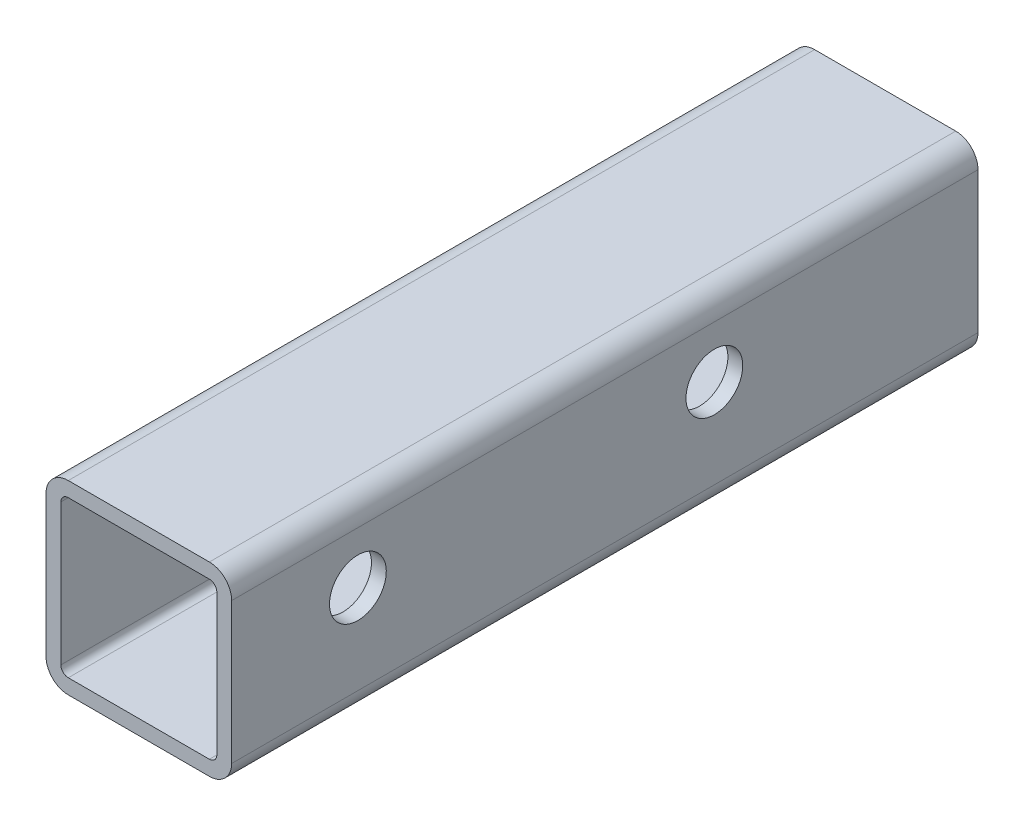
ISO-10303-21;
HEADER;
FILE_DESCRIPTION(('STEP AP214'),'2;1');
FILE_NAME('part.step','',(''),(''),'','','');
FILE_SCHEMA(('AUTOMOTIVE_DESIGN { 1 0 10303 214 1 1 1 1 }'));
ENDSEC;
DATA;
#1=APPLICATION_CONTEXT('core data for automotive mechanical design processes');
#2=APPLICATION_PROTOCOL_DEFINITION('international standard','automotive_design',2000,#1);
#3=PRODUCT_CONTEXT('',#1,'mechanical');
#4=PRODUCT('Part','Part','',(#3));
#5=PRODUCT_RELATED_PRODUCT_CATEGORY('part','',(#4));
#6=PRODUCT_DEFINITION_FORMATION('','',#4);
#7=PRODUCT_DEFINITION_CONTEXT('part definition',#1,'design');
#8=PRODUCT_DEFINITION('design','',#6,#7);
#9=PRODUCT_DEFINITION_SHAPE('','',#8);
#10=(LENGTH_UNIT() NAMED_UNIT(*) SI_UNIT(.MILLI.,.METRE.));
#11=(NAMED_UNIT(*) PLANE_ANGLE_UNIT() SI_UNIT($,.RADIAN.));
#12=(NAMED_UNIT(*) SI_UNIT($,.STERADIAN.) SOLID_ANGLE_UNIT());
#13=UNCERTAINTY_MEASURE_WITH_UNIT(LENGTH_MEASURE(1.E-05),#10,'distance_accuracy_value','');
#14=(GEOMETRIC_REPRESENTATION_CONTEXT(3) GLOBAL_UNCERTAINTY_ASSIGNED_CONTEXT((#13)) GLOBAL_UNIT_ASSIGNED_CONTEXT((#10,
#11,#12)) REPRESENTATION_CONTEXT('',''));
#15=CARTESIAN_POINT('',(0.,0.,0.));
#16=DIRECTION('',(0.,0.,1.));
#17=DIRECTION('',(1.,0.,0.));
#18=AXIS2_PLACEMENT_3D('',#15,#16,#17);
#19=CARTESIAN_POINT('',(-5.40456568387526E-12,-5.25801624462474E-12,100.500000000007));
#20=DIRECTION('',(0.,0.,1.));
#21=DIRECTION('',(0.,-1.,0.));
#22=AXIS2_PLACEMENT_3D('',#19,#20,#21);
#23=PLANE('',#22);
#24=DIRECTION('',(0.,1.,0.));
#25=VECTOR('',#24,1.);
#26=CARTESIAN_POINT('',(-12.5000000000054,-4.75000000000541,100.500000000007));
#27=LINE('',#26,#25);
#28=CARTESIAN_POINT('',(-12.5000000000054,-9.50000000000536,100.500000000007));
#29=VERTEX_POINT('',#28);
#30=CARTESIAN_POINT('',(-12.5000000000054,9.49999999999463,100.500000000007));
#31=VERTEX_POINT('',#30);
#32=EDGE_CURVE('E167',#29,#31,#27,.T.);
#33=ORIENTED_EDGE('',*,*,#32,.F.);
#34=CARTESIAN_POINT('',(-9.5000000000054,-9.50000000000529,100.500000000007));
#35=DIRECTION('',(0.,0.,-1.));
#36=DIRECTION('',(1.,0.,0.));
#37=AXIS2_PLACEMENT_3D('',#34,#35,#36);
#38=CIRCLE('',#37,3.);
#39=CARTESIAN_POINT('',(-9.50000000000539,-12.5000000000053,100.500000000007));
#40=VERTEX_POINT('',#39);
#41=EDGE_CURVE('E185',#40,#29,#38,.T.);
#42=ORIENTED_EDGE('',*,*,#41,.F.);
#43=DIRECTION('',(-1.,0.,0.));
#44=VECTOR('',#43,1.);
#45=CARTESIAN_POINT('',(4.7499999999946,-12.5000000000053,100.500000000007));
#46=LINE('',#45,#44);
#47=CARTESIAN_POINT('',(9.49999999999459,-12.5000000000053,100.500000000007));
#48=VERTEX_POINT('',#47);
#49=EDGE_CURVE('E260',#48,#40,#46,.T.);
#50=ORIENTED_EDGE('',*,*,#49,.F.);
#51=CARTESIAN_POINT('',(9.49999999999459,-9.50000000000529,100.500000000007));
#52=DIRECTION('',(0.,0.,-1.));
#53=DIRECTION('',(0.,1.,0.));
#54=AXIS2_PLACEMENT_3D('',#51,#52,#53);
#55=CIRCLE('',#54,3.);
#56=CARTESIAN_POINT('',(12.4999999999946,-9.50000000000529,100.500000000007));
#57=VERTEX_POINT('',#56);
#58=EDGE_CURVE('E265',#57,#48,#55,.T.);
#59=ORIENTED_EDGE('',*,*,#58,.F.);
#60=DIRECTION('',(0.,-1.,0.));
#61=VECTOR('',#60,1.);
#62=CARTESIAN_POINT('',(12.4999999999946,4.74999999999469,100.500000000007));
#63=LINE('',#62,#61);
#64=CARTESIAN_POINT('',(12.4999999999946,9.4999999999947,100.500000000007));
#65=VERTEX_POINT('',#64);
#66=EDGE_CURVE('E241',#65,#57,#63,.T.);
#67=ORIENTED_EDGE('',*,*,#66,.F.);
#68=CARTESIAN_POINT('',(9.49999999999459,9.49999999999477,100.500000000007));
#69=DIRECTION('',(0.,0.,-1.));
#70=DIRECTION('',(-1.,0.,0.));
#71=AXIS2_PLACEMENT_3D('',#68,#69,#70);
#72=CIRCLE('',#71,3.);
#73=CARTESIAN_POINT('',(9.49999999999459,12.4999999999947,100.500000000007));
#74=VERTEX_POINT('',#73);
#75=EDGE_CURVE('E27',#74,#65,#72,.T.);
#76=ORIENTED_EDGE('',*,*,#75,.F.);
#77=DIRECTION('',(1.,0.,0.));
#78=VECTOR('',#77,1.);
#79=CARTESIAN_POINT('',(-4.75000000000541,12.4999999999946,100.500000000007));
#80=LINE('',#79,#78);
#81=CARTESIAN_POINT('',(-9.50000000000541,12.4999999999947,100.500000000007));
#82=VERTEX_POINT('',#81);
#83=EDGE_CURVE('E169',#82,#74,#80,.T.);
#84=ORIENTED_EDGE('',*,*,#83,.F.);
#85=CARTESIAN_POINT('',(-9.5000000000054,9.49999999999477,100.500000000007));
#86=DIRECTION('',(0.,0.,-1.));
#87=DIRECTION('',(0.,-1.,0.));
#88=AXIS2_PLACEMENT_3D('',#85,#86,#87);
#89=CIRCLE('',#88,3.);
#90=EDGE_CURVE('E218',#31,#82,#89,.T.);
#91=ORIENTED_EDGE('',*,*,#90,.F.);
#92=EDGE_LOOP('',(#33,#42,#50,#59,#67,#76,#84,#91));
#93=FACE_BOUND('',#92,.T.);
#94=DIRECTION('',(-1.,0.,0.));
#95=VECTOR('',#94,1.);
#96=CARTESIAN_POINT('',(-4.75000000000541,10.4999999999947,100.500000000007));
#97=LINE('',#96,#95);
#98=CARTESIAN_POINT('',(9.49999999999459,10.4999999999947,100.500000000007));
#99=VERTEX_POINT('',#98);
#100=CARTESIAN_POINT('',(-9.5000000000054,10.4999999999947,100.500000000007));
#101=VERTEX_POINT('',#100);
#102=EDGE_CURVE('E98',#99,#101,#97,.T.);
#103=ORIENTED_EDGE('',*,*,#102,.F.);
#104=CARTESIAN_POINT('',(9.49999999999459,9.49999999999477,100.500000000007));
#105=DIRECTION('',(0.,0.,1.));
#106=DIRECTION('',(-1.,0.,0.));
#107=AXIS2_PLACEMENT_3D('',#104,#105,#106);
#108=CIRCLE('',#107,1.);
#109=CARTESIAN_POINT('',(10.4999999999946,9.49999999999477,100.500000000007));
#110=VERTEX_POINT('',#109);
#111=EDGE_CURVE('E212',#110,#99,#108,.T.);
#112=ORIENTED_EDGE('',*,*,#111,.F.);
#113=DIRECTION('',(0.,1.,0.));
#114=VECTOR('',#113,1.);
#115=CARTESIAN_POINT('',(10.4999999999946,4.74999999999476,100.500000000007));
#116=LINE('',#115,#114);
#117=CARTESIAN_POINT('',(10.4999999999946,-9.50000000000529,100.500000000007));
#118=VERTEX_POINT('',#117);
#119=EDGE_CURVE('E205',#118,#110,#116,.T.);
#120=ORIENTED_EDGE('',*,*,#119,.F.);
#121=CARTESIAN_POINT('',(9.49999999999459,-9.50000000000529,100.500000000007));
#122=DIRECTION('',(0.,0.,1.));
#123=DIRECTION('',(0.,1.,0.));
#124=AXIS2_PLACEMENT_3D('',#121,#122,#123);
#125=CIRCLE('',#124,1.);
#126=CARTESIAN_POINT('',(9.49999999999459,-10.5000000000052,100.500000000007));
#127=VERTEX_POINT('',#126);
#128=EDGE_CURVE('E190',#127,#118,#125,.T.);
#129=ORIENTED_EDGE('',*,*,#128,.F.);
#130=DIRECTION('',(1.,0.,0.));
#131=VECTOR('',#130,1.);
#132=CARTESIAN_POINT('',(4.7499999999946,-10.5000000000053,100.500000000007));
#133=LINE('',#132,#131);
#134=CARTESIAN_POINT('',(-9.5000000000054,-10.5000000000052,100.500000000007));
#135=VERTEX_POINT('',#134);
#136=EDGE_CURVE('E293',#135,#127,#133,.T.);
#137=ORIENTED_EDGE('',*,*,#136,.F.);
#138=CARTESIAN_POINT('',(-9.5000000000054,-9.50000000000529,100.500000000007));
#139=DIRECTION('',(0.,0.,1.));
#140=DIRECTION('',(1.,0.,0.));
#141=AXIS2_PLACEMENT_3D('',#138,#139,#140);
#142=CIRCLE('',#141,1.);
#143=CARTESIAN_POINT('',(-10.5000000000054,-9.50000000000529,100.500000000007));
#144=VERTEX_POINT('',#143);
#145=EDGE_CURVE('E282',#144,#135,#142,.T.);
#146=ORIENTED_EDGE('',*,*,#145,.F.);
#147=DIRECTION('',(0.,-1.,0.));
#148=VECTOR('',#147,1.);
#149=CARTESIAN_POINT('',(-10.5000000000054,-4.75000000000527,100.500000000007));
#150=LINE('',#149,#148);
#151=CARTESIAN_POINT('',(-10.5000000000054,9.49999999999477,100.500000000007));
#152=VERTEX_POINT('',#151);
#153=EDGE_CURVE('E142',#152,#144,#150,.T.);
#154=ORIENTED_EDGE('',*,*,#153,.F.);
#155=CARTESIAN_POINT('',(-9.5000000000054,9.49999999999477,100.500000000007));
#156=DIRECTION('',(0.,0.,1.));
#157=DIRECTION('',(0.,-1.,0.));
#158=AXIS2_PLACEMENT_3D('',#155,#156,#157);
#159=CIRCLE('',#158,1.);
#160=EDGE_CURVE('E140',#101,#152,#159,.T.);
#161=ORIENTED_EDGE('',*,*,#160,.F.);
#162=EDGE_LOOP('',(#103,#112,#120,#129,#137,#146,#154,#161));
#163=FACE_BOUND('',#162,.T.);
#164=ADVANCED_FACE('F16',(#93,#163),#23,.T.);
#165=CARTESIAN_POINT('',(-5.40456568387526E-12,-5.25801624462474E-12,7.38964445190504E-12));
#166=DIRECTION('',(0.,0.,1.));
#167=DIRECTION('',(0.,-1.,0.));
#168=AXIS2_PLACEMENT_3D('',#165,#166,#167);
#169=PLANE('',#168);
#170=DIRECTION('',(0.,1.,0.));
#171=VECTOR('',#170,1.);
#172=CARTESIAN_POINT('',(-12.5000000000054,-4.75000000000541,7.38964445190504E-12));
#173=LINE('',#172,#171);
#174=CARTESIAN_POINT('',(-12.5000000000054,-9.50000000000536,7.38964445190504E-12));
#175=VERTEX_POINT('',#174);
#176=CARTESIAN_POINT('',(-12.5000000000054,9.49999999999463,7.38964445190504E-12));
#177=VERTEX_POINT('',#176);
#178=EDGE_CURVE('E215',#175,#177,#173,.T.);
#179=ORIENTED_EDGE('',*,*,#178,.T.);
#180=CARTESIAN_POINT('',(-9.50000000000541,9.49999999999477,7.38964445190504E-12));
#181=DIRECTION('',(0.,0.,-1.));
#182=DIRECTION('',(0.,-1.,0.));
#183=AXIS2_PLACEMENT_3D('',#180,#181,#182);
#184=CIRCLE('',#183,3.);
#185=CARTESIAN_POINT('',(-9.50000000000541,12.4999999999947,7.38964445190504E-12));
#186=VERTEX_POINT('',#185);
#187=EDGE_CURVE('E174',#177,#186,#184,.T.);
#188=ORIENTED_EDGE('',*,*,#187,.T.);
#189=DIRECTION('',(1.,0.,0.));
#190=VECTOR('',#189,1.);
#191=CARTESIAN_POINT('',(-4.75000000000541,12.4999999999946,7.38964445190504E-12));
#192=LINE('',#191,#190);
#193=CARTESIAN_POINT('',(9.49999999999459,12.4999999999947,7.38964445190504E-12));
#194=VERTEX_POINT('',#193);
#195=EDGE_CURVE('E276',#186,#194,#192,.T.);
#196=ORIENTED_EDGE('',*,*,#195,.T.);
#197=CARTESIAN_POINT('',(9.49999999999459,9.49999999999477,7.38964445190504E-12));
#198=DIRECTION('',(0.,0.,-1.));
#199=DIRECTION('',(-1.,0.,0.));
#200=AXIS2_PLACEMENT_3D('',#197,#198,#199);
#201=CIRCLE('',#200,3.);
#202=CARTESIAN_POINT('',(12.4999999999946,9.4999999999947,7.38964445190504E-12));
#203=VERTEX_POINT('',#202);
#204=EDGE_CURVE('E11',#194,#203,#201,.T.);
#205=ORIENTED_EDGE('',*,*,#204,.T.);
#206=DIRECTION('',(0.,-1.,0.));
#207=VECTOR('',#206,1.);
#208=CARTESIAN_POINT('',(12.4999999999946,4.74999999999469,7.38964445190504E-12));
#209=LINE('',#208,#207);
#210=CARTESIAN_POINT('',(12.4999999999946,-9.50000000000529,7.38964445190504E-12));
#211=VERTEX_POINT('',#210);
#212=EDGE_CURVE('E266',#203,#211,#209,.T.);
#213=ORIENTED_EDGE('',*,*,#212,.T.);
#214=CARTESIAN_POINT('',(9.49999999999459,-9.50000000000529,7.38964445190504E-12));
#215=DIRECTION('',(0.,0.,-1.));
#216=DIRECTION('',(0.,1.,0.));
#217=AXIS2_PLACEMENT_3D('',#214,#215,#216);
#218=CIRCLE('',#217,3.);
#219=CARTESIAN_POINT('',(9.49999999999459,-12.5000000000053,7.38964445190504E-12));
#220=VERTEX_POINT('',#219);
#221=EDGE_CURVE('E306',#211,#220,#218,.T.);
#222=ORIENTED_EDGE('',*,*,#221,.T.);
#223=DIRECTION('',(-1.,0.,0.));
#224=VECTOR('',#223,1.);
#225=CARTESIAN_POINT('',(4.7499999999946,-12.5000000000053,7.38964445190504E-12));
#226=LINE('',#225,#224);
#227=CARTESIAN_POINT('',(-9.5000000000054,-12.5000000000053,7.38964445190504E-12));
#228=VERTEX_POINT('',#227);
#229=EDGE_CURVE('E181',#220,#228,#226,.T.);
#230=ORIENTED_EDGE('',*,*,#229,.T.);
#231=CARTESIAN_POINT('',(-9.5000000000054,-9.50000000000529,7.38964445190504E-12));
#232=DIRECTION('',(0.,0.,-1.));
#233=DIRECTION('',(1.,0.,0.));
#234=AXIS2_PLACEMENT_3D('',#231,#232,#233);
#235=CIRCLE('',#234,3.);
#236=EDGE_CURVE('E156',#228,#175,#235,.T.);
#237=ORIENTED_EDGE('',*,*,#236,.T.);
#238=EDGE_LOOP('',(#179,#188,#196,#205,#213,#222,#230,#237));
#239=FACE_BOUND('',#238,.T.);
#240=DIRECTION('',(-1.,0.,0.));
#241=VECTOR('',#240,1.);
#242=CARTESIAN_POINT('',(-4.75000000000541,10.4999999999947,7.38964445190504E-12));
#243=LINE('',#242,#241);
#244=CARTESIAN_POINT('',(9.49999999999459,10.4999999999947,7.38964445190504E-12));
#245=VERTEX_POINT('',#244);
#246=CARTESIAN_POINT('',(-9.5000000000054,10.4999999999947,7.38964445190504E-12));
#247=VERTEX_POINT('',#246);
#248=EDGE_CURVE('E81',#245,#247,#243,.T.);
#249=ORIENTED_EDGE('',*,*,#248,.T.);
#250=CARTESIAN_POINT('',(-9.50000000000541,9.49999999999477,7.38964445190504E-12));
#251=DIRECTION('',(0.,0.,1.));
#252=DIRECTION('',(0.,-1.,0.));
#253=AXIS2_PLACEMENT_3D('',#250,#251,#252);
#254=CIRCLE('',#253,1.);
#255=CARTESIAN_POINT('',(-10.5000000000054,9.49999999999477,7.38964445190504E-12));
#256=VERTEX_POINT('',#255);
#257=EDGE_CURVE('E135',#247,#256,#254,.T.);
#258=ORIENTED_EDGE('',*,*,#257,.T.);
#259=DIRECTION('',(0.,-1.,0.));
#260=VECTOR('',#259,1.);
#261=CARTESIAN_POINT('',(-10.5000000000054,-4.75000000000527,7.38964445190504E-12));
#262=LINE('',#261,#260);
#263=CARTESIAN_POINT('',(-10.5000000000054,-9.50000000000529,7.38964445190504E-12));
#264=VERTEX_POINT('',#263);
#265=EDGE_CURVE('E193',#256,#264,#262,.T.);
#266=ORIENTED_EDGE('',*,*,#265,.T.);
#267=CARTESIAN_POINT('',(-9.5000000000054,-9.50000000000529,7.38964445190504E-12));
#268=DIRECTION('',(0.,0.,1.));
#269=DIRECTION('',(1.,0.,0.));
#270=AXIS2_PLACEMENT_3D('',#267,#268,#269);
#271=CIRCLE('',#270,1.);
#272=CARTESIAN_POINT('',(-9.5000000000054,-10.5000000000052,7.38964445190504E-12));
#273=VERTEX_POINT('',#272);
#274=EDGE_CURVE('E281',#264,#273,#271,.T.);
#275=ORIENTED_EDGE('',*,*,#274,.T.);
#276=DIRECTION('',(1.,0.,0.));
#277=VECTOR('',#276,1.);
#278=CARTESIAN_POINT('',(4.7499999999946,-10.5000000000053,7.38964445190504E-12));
#279=LINE('',#278,#277);
#280=CARTESIAN_POINT('',(9.49999999999459,-10.5000000000052,7.38964445190504E-12));
#281=VERTEX_POINT('',#280);
#282=EDGE_CURVE('E175',#273,#281,#279,.T.);
#283=ORIENTED_EDGE('',*,*,#282,.T.);
#284=CARTESIAN_POINT('',(9.49999999999459,-9.50000000000529,7.38964445190504E-12));
#285=DIRECTION('',(0.,0.,1.));
#286=DIRECTION('',(0.,1.,0.));
#287=AXIS2_PLACEMENT_3D('',#284,#285,#286);
#288=CIRCLE('',#287,1.);
#289=CARTESIAN_POINT('',(10.4999999999946,-9.50000000000529,7.38964445190504E-12));
#290=VERTEX_POINT('',#289);
#291=EDGE_CURVE('E230',#281,#290,#288,.T.);
#292=ORIENTED_EDGE('',*,*,#291,.T.);
#293=DIRECTION('',(0.,1.,0.));
#294=VECTOR('',#293,1.);
#295=CARTESIAN_POINT('',(10.4999999999946,4.74999999999476,7.38964445190504E-12));
#296=LINE('',#295,#294);
#297=CARTESIAN_POINT('',(10.4999999999946,9.49999999999477,7.38964445190504E-12));
#298=VERTEX_POINT('',#297);
#299=EDGE_CURVE('E204',#290,#298,#296,.T.);
#300=ORIENTED_EDGE('',*,*,#299,.T.);
#301=CARTESIAN_POINT('',(9.49999999999459,9.49999999999477,7.38964445190504E-12));
#302=DIRECTION('',(0.,0.,1.));
#303=DIRECTION('',(-1.,0.,0.));
#304=AXIS2_PLACEMENT_3D('',#301,#302,#303);
#305=CIRCLE('',#304,1.);
#306=EDGE_CURVE('E211',#298,#245,#305,.T.);
#307=ORIENTED_EDGE('',*,*,#306,.T.);
#308=EDGE_LOOP('',(#249,#258,#266,#275,#283,#292,#300,#307));
#309=FACE_BOUND('',#308,.T.);
#310=ADVANCED_FACE('F228',(#239,#309),#169,.F.);
#311=CARTESIAN_POINT('',(9.49999999999459,9.49999999999477,7.38964445190504E-12));
#312=DIRECTION('',(0.,0.,1.));
#313=DIRECTION('',(-1.,0.,0.));
#314=AXIS2_PLACEMENT_3D('',#311,#312,#313);
#315=CYLINDRICAL_SURFACE('',#314,3.);
#316=ORIENTED_EDGE('',*,*,#75,.T.);
#317=DIRECTION('',(0.,0.,1.));
#318=VECTOR('',#317,1.);
#319=CARTESIAN_POINT('',(12.4999999999946,9.4999999999947,7.38964445190504E-12));
#320=LINE('',#319,#318);
#321=EDGE_CURVE('E261',#203,#65,#320,.T.);
#322=ORIENTED_EDGE('',*,*,#321,.F.);
#323=ORIENTED_EDGE('',*,*,#204,.F.);
#324=DIRECTION('',(0.,0.,1.));
#325=VECTOR('',#324,1.);
#326=CARTESIAN_POINT('',(9.49999999999459,12.4999999999947,7.38964445190504E-12));
#327=LINE('',#326,#325);
#328=EDGE_CURVE('E173',#194,#74,#327,.T.);
#329=ORIENTED_EDGE('',*,*,#328,.T.);
#330=EDGE_LOOP('',(#316,#322,#323,#329));
#331=FACE_BOUND('',#330,.T.);
#332=ADVANCED_FACE('F340',(#331),#315,.T.);
#333=CARTESIAN_POINT('',(-9.50000000000541,12.4999999999947,7.38964445190504E-12));
#334=DIRECTION('',(0.,1.,0.));
#335=DIRECTION('',(1.,0.,0.));
#336=AXIS2_PLACEMENT_3D('',#333,#334,#335);
#337=PLANE('',#336);
#338=ORIENTED_EDGE('',*,*,#83,.T.);
#339=ORIENTED_EDGE('',*,*,#328,.F.);
#340=ORIENTED_EDGE('',*,*,#195,.F.);
#341=DIRECTION('',(0.,0.,1.));
#342=VECTOR('',#341,1.);
#343=CARTESIAN_POINT('',(-9.50000000000541,12.4999999999947,7.38964445190504E-12));
#344=LINE('',#343,#342);
#345=EDGE_CURVE('E273',#186,#82,#344,.T.);
#346=ORIENTED_EDGE('',*,*,#345,.T.);
#347=EDGE_LOOP('',(#338,#339,#340,#346));
#348=FACE_BOUND('',#347,.T.);
#349=ADVANCED_FACE('F345',(#348),#337,.T.);
#350=CARTESIAN_POINT('',(-9.50000000000541,9.49999999999477,7.38964445190504E-12));
#351=DIRECTION('',(0.,0.,1.));
#352=DIRECTION('',(0.,-1.,0.));
#353=AXIS2_PLACEMENT_3D('',#350,#351,#352);
#354=CYLINDRICAL_SURFACE('',#353,3.);
#355=ORIENTED_EDGE('',*,*,#90,.T.);
#356=ORIENTED_EDGE('',*,*,#345,.F.);
#357=ORIENTED_EDGE('',*,*,#187,.F.);
#358=DIRECTION('',(0.,0.,1.));
#359=VECTOR('',#358,1.);
#360=CARTESIAN_POINT('',(-12.5000000000054,9.49999999999463,7.38964445190504E-12));
#361=LINE('',#360,#359);
#362=EDGE_CURVE('E219',#177,#31,#361,.T.);
#363=ORIENTED_EDGE('',*,*,#362,.T.);
#364=EDGE_LOOP('',(#355,#356,#357,#363));
#365=FACE_BOUND('',#364,.T.);
#366=ADVANCED_FACE('F18',(#365),#354,.T.);
#367=CARTESIAN_POINT('',(-12.5000000000054,-9.50000000000536,7.38964445190504E-12));
#368=DIRECTION('',(-1.,0.,0.));
#369=DIRECTION('',(0.,1.,0.));
#370=AXIS2_PLACEMENT_3D('',#367,#368,#369);
#371=PLANE('',#370);
#372=ORIENTED_EDGE('',*,*,#32,.T.);
#373=ORIENTED_EDGE('',*,*,#362,.F.);
#374=ORIENTED_EDGE('',*,*,#178,.F.);
#375=DIRECTION('',(0.,0.,1.));
#376=VECTOR('',#375,1.);
#377=CARTESIAN_POINT('',(-12.5000000000054,-9.50000000000536,7.38964445190504E-12));
#378=LINE('',#377,#376);
#379=EDGE_CURVE('E163',#175,#29,#378,.T.);
#380=ORIENTED_EDGE('',*,*,#379,.T.);
#381=EDGE_LOOP('',(#372,#373,#374,#380));
#382=FACE_BOUND('',#381,.T.);
#383=ADVANCED_FACE('F373',(#382),#371,.T.);
#384=CARTESIAN_POINT('',(-9.50000000000541,9.49999999999477,7.38964445190504E-12));
#385=DIRECTION('',(0.,0.,1.));
#386=DIRECTION('',(0.,-1.,0.));
#387=AXIS2_PLACEMENT_3D('',#384,#385,#386);
#388=CYLINDRICAL_SURFACE('',#387,1.);
#389=ORIENTED_EDGE('',*,*,#160,.T.);
#390=DIRECTION('',(0.,0.,1.));
#391=VECTOR('',#390,1.);
#392=CARTESIAN_POINT('',(-10.5000000000054,9.49999999999477,7.38964445190504E-12));
#393=LINE('',#392,#391);
#394=EDGE_CURVE('E145',#256,#152,#393,.T.);
#395=ORIENTED_EDGE('',*,*,#394,.F.);
#396=ORIENTED_EDGE('',*,*,#257,.F.);
#397=DIRECTION('',(0.,0.,1.));
#398=VECTOR('',#397,1.);
#399=CARTESIAN_POINT('',(-9.5000000000054,10.4999999999947,7.38964445190504E-12));
#400=LINE('',#399,#398);
#401=EDGE_CURVE('E147',#247,#101,#400,.T.);
#402=ORIENTED_EDGE('',*,*,#401,.T.);
#403=EDGE_LOOP('',(#389,#395,#396,#402));
#404=FACE_BOUND('',#403,.T.);
#405=ADVANCED_FACE('F148',(#404),#388,.F.);
#406=CARTESIAN_POINT('',(-10.5000000000054,-9.50000000000529,7.38964445190504E-12));
#407=DIRECTION('',(-1.,0.,0.));
#408=DIRECTION('',(0.,1.,0.));
#409=AXIS2_PLACEMENT_3D('',#406,#407,#408);
#410=PLANE('',#409);
#411=ORIENTED_EDGE('',*,*,#153,.T.);
#412=DIRECTION('',(0.,0.,1.));
#413=VECTOR('',#412,1.);
#414=CARTESIAN_POINT('',(-10.5000000000054,-9.50000000000529,7.38964445190504E-12));
#415=LINE('',#414,#413);
#416=EDGE_CURVE('E277',#264,#144,#415,.T.);
#417=ORIENTED_EDGE('',*,*,#416,.F.);
#418=ORIENTED_EDGE('',*,*,#265,.F.);
#419=ORIENTED_EDGE('',*,*,#394,.T.);
#420=EDGE_LOOP('',(#411,#417,#418,#419));
#421=FACE_BOUND('',#420,.T.);
#422=ADVANCED_FACE('F349',(#421),#410,.F.);
#423=CARTESIAN_POINT('',(-9.5000000000054,-9.50000000000529,7.38964445190504E-12));
#424=DIRECTION('',(0.,0.,1.));
#425=DIRECTION('',(1.,0.,0.));
#426=AXIS2_PLACEMENT_3D('',#423,#424,#425);
#427=CYLINDRICAL_SURFACE('',#426,1.);
#428=ORIENTED_EDGE('',*,*,#145,.T.);
#429=DIRECTION('',(0.,0.,1.));
#430=VECTOR('',#429,1.);
#431=CARTESIAN_POINT('',(-9.5000000000054,-10.5000000000052,7.38964445190504E-12));
#432=LINE('',#431,#430);
#433=EDGE_CURVE('E179',#273,#135,#432,.T.);
#434=ORIENTED_EDGE('',*,*,#433,.F.);
#435=ORIENTED_EDGE('',*,*,#274,.F.);
#436=ORIENTED_EDGE('',*,*,#416,.T.);
#437=EDGE_LOOP('',(#428,#434,#435,#436));
#438=FACE_BOUND('',#437,.T.);
#439=ADVANCED_FACE('F346',(#438),#427,.F.);
#440=CARTESIAN_POINT('',(-9.5000000000054,10.4999999999947,7.38964445190504E-12));
#441=DIRECTION('',(0.,1.,0.));
#442=DIRECTION('',(1.,0.,0.));
#443=AXIS2_PLACEMENT_3D('',#440,#441,#442);
#444=PLANE('',#443);
#445=ORIENTED_EDGE('',*,*,#102,.T.);
#446=ORIENTED_EDGE('',*,*,#401,.F.);
#447=ORIENTED_EDGE('',*,*,#248,.F.);
#448=DIRECTION('',(0.,0.,1.));
#449=VECTOR('',#448,1.);
#450=CARTESIAN_POINT('',(9.49999999999459,10.4999999999947,7.38964445190504E-12));
#451=LINE('',#450,#449);
#452=EDGE_CURVE('E153',#245,#99,#451,.T.);
#453=ORIENTED_EDGE('',*,*,#452,.T.);
#454=EDGE_LOOP('',(#445,#446,#447,#453));
#455=FACE_BOUND('',#454,.T.);
#456=ADVANCED_FACE('F151',(#455),#444,.F.);
#457=CARTESIAN_POINT('',(-9.5000000000054,-9.50000000000529,7.38964445190504E-12));
#458=DIRECTION('',(0.,0.,1.));
#459=DIRECTION('',(1.,0.,0.));
#460=AXIS2_PLACEMENT_3D('',#457,#458,#459);
#461=CYLINDRICAL_SURFACE('',#460,3.);
#462=ORIENTED_EDGE('',*,*,#41,.T.);
#463=ORIENTED_EDGE('',*,*,#379,.F.);
#464=ORIENTED_EDGE('',*,*,#236,.F.);
#465=DIRECTION('',(0.,0.,1.));
#466=VECTOR('',#465,1.);
#467=CARTESIAN_POINT('',(-9.5000000000054,-12.5000000000053,7.38964445190504E-12));
#468=LINE('',#467,#466);
#469=EDGE_CURVE('E186',#228,#40,#468,.T.);
#470=ORIENTED_EDGE('',*,*,#469,.T.);
#471=EDGE_LOOP('',(#462,#463,#464,#470));
#472=FACE_BOUND('',#471,.T.);
#473=ADVANCED_FACE('F364',(#472),#461,.T.);
#474=CARTESIAN_POINT('',(9.49999999999459,-12.5000000000053,7.38964445190504E-12));
#475=DIRECTION('',(0.,-1.,0.));
#476=DIRECTION('',(0.,0.,-1.));
#477=AXIS2_PLACEMENT_3D('',#474,#475,#476);
#478=PLANE('',#477);
#479=ORIENTED_EDGE('',*,*,#49,.T.);
#480=ORIENTED_EDGE('',*,*,#469,.F.);
#481=ORIENTED_EDGE('',*,*,#229,.F.);
#482=DIRECTION('',(0.,0.,1.));
#483=VECTOR('',#482,1.);
#484=CARTESIAN_POINT('',(9.49999999999459,-12.5000000000053,7.38964445190504E-12));
#485=LINE('',#484,#483);
#486=EDGE_CURVE('E20',#220,#48,#485,.T.);
#487=ORIENTED_EDGE('',*,*,#486,.T.);
#488=EDGE_LOOP('',(#479,#480,#481,#487));
#489=FACE_BOUND('',#488,.T.);
#490=ADVANCED_FACE('F358',(#489),#478,.T.);
#491=CARTESIAN_POINT('',(9.49999999999459,-9.50000000000529,7.38964445190504E-12));
#492=DIRECTION('',(0.,0.,1.));
#493=DIRECTION('',(0.,1.,0.));
#494=AXIS2_PLACEMENT_3D('',#491,#492,#493);
#495=CYLINDRICAL_SURFACE('',#494,3.);
#496=ORIENTED_EDGE('',*,*,#58,.T.);
#497=ORIENTED_EDGE('',*,*,#486,.F.);
#498=ORIENTED_EDGE('',*,*,#221,.F.);
#499=DIRECTION('',(0.,0.,1.));
#500=VECTOR('',#499,1.);
#501=CARTESIAN_POINT('',(12.4999999999946,-9.50000000000529,7.38964445190504E-12));
#502=LINE('',#501,#500);
#503=EDGE_CURVE('E247',#211,#57,#502,.T.);
#504=ORIENTED_EDGE('',*,*,#503,.T.);
#505=EDGE_LOOP('',(#496,#497,#498,#504));
#506=FACE_BOUND('',#505,.T.);
#507=ADVANCED_FACE('F354',(#506),#495,.T.);
#508=CARTESIAN_POINT('',(12.4999999999946,9.4999999999947,7.38964445190504E-12));
#509=DIRECTION('',(1.,0.,0.));
#510=DIRECTION('',(0.,1.,0.));
#511=AXIS2_PLACEMENT_3D('',#508,#509,#510);
#512=PLANE('',#511);
#513=ORIENTED_EDGE('',*,*,#66,.T.);
#514=ORIENTED_EDGE('',*,*,#503,.F.);
#515=ORIENTED_EDGE('',*,*,#212,.F.);
#516=ORIENTED_EDGE('',*,*,#321,.T.);
#517=EDGE_LOOP('',(#513,#514,#515,#516));
#518=FACE_BOUND('',#517,.T.);
#519=CARTESIAN_POINT('',(12.4999999999946,2.49999999999609,35.5000000000069));
#520=DIRECTION('',(-1.,0.,0.));
#521=DIRECTION('',(0.,-1.,0.));
#522=AXIS2_PLACEMENT_3D('',#519,#520,#521);
#523=CIRCLE('',#522,3.8235);
#524=CARTESIAN_POINT('',(12.4999999999946,-1.32350000000393,35.5000000000069));
#525=VERTEX_POINT('',#524);
#526=EDGE_CURVE('E411',#525,#525,#523,.T.);
#527=ORIENTED_EDGE('',*,*,#526,.T.);
#528=EDGE_LOOP('',(#527));
#529=FACE_BOUND('',#528,.T.);
#530=CARTESIAN_POINT('',(12.4999999999946,2.49999999999872,83.5000000000031));
#531=DIRECTION('',(-1.,0.,0.));
#532=DIRECTION('',(0.,-1.,0.));
#533=AXIS2_PLACEMENT_3D('',#530,#531,#532);
#534=CIRCLE('',#533,3.8235);
#535=CARTESIAN_POINT('',(12.4999999999946,-1.3235000000013,83.5000000000031));
#536=VERTEX_POINT('',#535);
#537=EDGE_CURVE('E194',#536,#536,#534,.T.);
#538=ORIENTED_EDGE('',*,*,#537,.T.);
#539=EDGE_LOOP('',(#538));
#540=FACE_BOUND('',#539,.T.);
#541=ADVANCED_FACE('F357',(#518,#529,#540),#512,.T.);
#542=CARTESIAN_POINT('',(9.49999999999459,9.49999999999477,7.38964445190504E-12));
#543=DIRECTION('',(0.,0.,1.));
#544=DIRECTION('',(-1.,0.,0.));
#545=AXIS2_PLACEMENT_3D('',#542,#543,#544);
#546=CYLINDRICAL_SURFACE('',#545,1.);
#547=ORIENTED_EDGE('',*,*,#111,.T.);
#548=ORIENTED_EDGE('',*,*,#452,.F.);
#549=ORIENTED_EDGE('',*,*,#306,.F.);
#550=DIRECTION('',(0.,0.,1.));
#551=VECTOR('',#550,1.);
#552=CARTESIAN_POINT('',(10.4999999999946,9.49999999999477,7.38964445190504E-12));
#553=LINE('',#552,#551);
#554=EDGE_CURVE('E200',#298,#110,#553,.T.);
#555=ORIENTED_EDGE('',*,*,#554,.T.);
#556=EDGE_LOOP('',(#547,#548,#549,#555));
#557=FACE_BOUND('',#556,.T.);
#558=ADVANCED_FACE('F239',(#557),#546,.F.);
#559=CARTESIAN_POINT('',(10.4999999999946,9.49999999999477,7.38964445190504E-12));
#560=DIRECTION('',(1.,0.,0.));
#561=DIRECTION('',(0.,-1.,0.));
#562=AXIS2_PLACEMENT_3D('',#559,#560,#561);
#563=PLANE('',#562);
#564=ORIENTED_EDGE('',*,*,#119,.T.);
#565=ORIENTED_EDGE('',*,*,#554,.F.);
#566=ORIENTED_EDGE('',*,*,#299,.F.);
#567=DIRECTION('',(0.,0.,1.));
#568=VECTOR('',#567,1.);
#569=CARTESIAN_POINT('',(10.4999999999946,-9.50000000000529,7.38964445190504E-12));
#570=LINE('',#569,#568);
#571=EDGE_CURVE('E253',#290,#118,#570,.T.);
#572=ORIENTED_EDGE('',*,*,#571,.T.);
#573=EDGE_LOOP('',(#564,#565,#566,#572));
#574=FACE_BOUND('',#573,.T.);
#575=CARTESIAN_POINT('',(10.4999999999946,2.49999999999609,35.5000000000069));
#576=DIRECTION('',(1.,0.,0.));
#577=DIRECTION('',(0.,-1.,0.));
#578=AXIS2_PLACEMENT_3D('',#575,#576,#577);
#579=CIRCLE('',#578,3.8235);
#580=CARTESIAN_POINT('',(10.4999999999946,6.32349999999612,35.5000000000069));
#581=VERTEX_POINT('',#580);
#582=EDGE_CURVE('E198',#581,#581,#579,.T.);
#583=ORIENTED_EDGE('',*,*,#582,.T.);
#584=EDGE_LOOP('',(#583));
#585=FACE_BOUND('',#584,.T.);
#586=CARTESIAN_POINT('',(10.4999999999946,2.49999999999872,83.5000000000031));
#587=DIRECTION('',(1.,0.,0.));
#588=DIRECTION('',(0.,-1.,0.));
#589=AXIS2_PLACEMENT_3D('',#586,#587,#588);
#590=CIRCLE('',#589,3.8235);
#591=CARTESIAN_POINT('',(10.4999999999946,6.32349999999875,83.5000000000031));
#592=VERTEX_POINT('',#591);
#593=EDGE_CURVE('E199',#592,#592,#590,.T.);
#594=ORIENTED_EDGE('',*,*,#593,.T.);
#595=EDGE_LOOP('',(#594));
#596=FACE_BOUND('',#595,.T.);
#597=ADVANCED_FACE('F235',(#574,#585,#596),#563,.F.);
#598=CARTESIAN_POINT('',(9.49999999999459,-9.50000000000529,7.38964445190504E-12));
#599=DIRECTION('',(0.,0.,1.));
#600=DIRECTION('',(0.,1.,0.));
#601=AXIS2_PLACEMENT_3D('',#598,#599,#600);
#602=CYLINDRICAL_SURFACE('',#601,1.);
#603=ORIENTED_EDGE('',*,*,#128,.T.);
#604=ORIENTED_EDGE('',*,*,#571,.F.);
#605=ORIENTED_EDGE('',*,*,#291,.F.);
#606=DIRECTION('',(0.,0.,1.));
#607=VECTOR('',#606,1.);
#608=CARTESIAN_POINT('',(9.49999999999459,-10.5000000000052,7.38964445190504E-12));
#609=LINE('',#608,#607);
#610=EDGE_CURVE('E180',#281,#127,#609,.T.);
#611=ORIENTED_EDGE('',*,*,#610,.T.);
#612=EDGE_LOOP('',(#603,#604,#605,#611));
#613=FACE_BOUND('',#612,.T.);
#614=ADVANCED_FACE('F360',(#613),#602,.F.);
#615=CARTESIAN_POINT('',(9.49999999999459,-10.5000000000052,7.38964445190504E-12));
#616=DIRECTION('',(0.,-1.,0.));
#617=DIRECTION('',(0.,0.,-1.));
#618=AXIS2_PLACEMENT_3D('',#615,#616,#617);
#619=PLANE('',#618);
#620=ORIENTED_EDGE('',*,*,#136,.T.);
#621=ORIENTED_EDGE('',*,*,#610,.F.);
#622=ORIENTED_EDGE('',*,*,#282,.F.);
#623=ORIENTED_EDGE('',*,*,#433,.T.);
#624=EDGE_LOOP('',(#620,#621,#622,#623));
#625=FACE_BOUND('',#624,.T.);
#626=ADVANCED_FACE('F328',(#625),#619,.F.);
#627=CARTESIAN_POINT('',(8.49999999999459,2.49999999999609,35.5000000000069));
#628=DIRECTION('',(1.,0.,0.));
#629=DIRECTION('',(0.,-1.,0.));
#630=AXIS2_PLACEMENT_3D('',#627,#628,#629);
#631=CYLINDRICAL_SURFACE('',#630,3.8235);
#632=ORIENTED_EDGE('',*,*,#526,.F.);
#633=EDGE_LOOP('',(#632));
#634=FACE_BOUND('',#633,.T.);
#635=ORIENTED_EDGE('',*,*,#582,.F.);
#636=EDGE_LOOP('',(#635));
#637=FACE_BOUND('',#636,.T.);
#638=ADVANCED_FACE('F321',(#634,#637),#631,.F.);
#639=CARTESIAN_POINT('',(8.49999999999459,2.49999999999872,83.5000000000031));
#640=DIRECTION('',(1.,0.,0.));
#641=DIRECTION('',(0.,-1.,0.));
#642=AXIS2_PLACEMENT_3D('',#639,#640,#641);
#643=CYLINDRICAL_SURFACE('',#642,3.8235);
#644=ORIENTED_EDGE('',*,*,#537,.F.);
#645=EDGE_LOOP('',(#644));
#646=FACE_BOUND('',#645,.T.);
#647=ORIENTED_EDGE('',*,*,#593,.F.);
#648=EDGE_LOOP('',(#647));
#649=FACE_BOUND('',#648,.T.);
#650=ADVANCED_FACE('F319',(#646,#649),#643,.F.);
#651=CLOSED_SHELL('',(#164,#310,#332,#349,#366,#383,#405,#422,#439,#456,#473,#490,#507,#541,
#558,#597,#614,#626,#638,#650));
#652=MANIFOLD_SOLID_BREP('B1',#651);
#653=ADVANCED_BREP_SHAPE_REPRESENTATION('',(#18,#652),#14);
#654=SHAPE_DEFINITION_REPRESENTATION(#9,#653);
ENDSEC;
END-ISO-10303-21;
